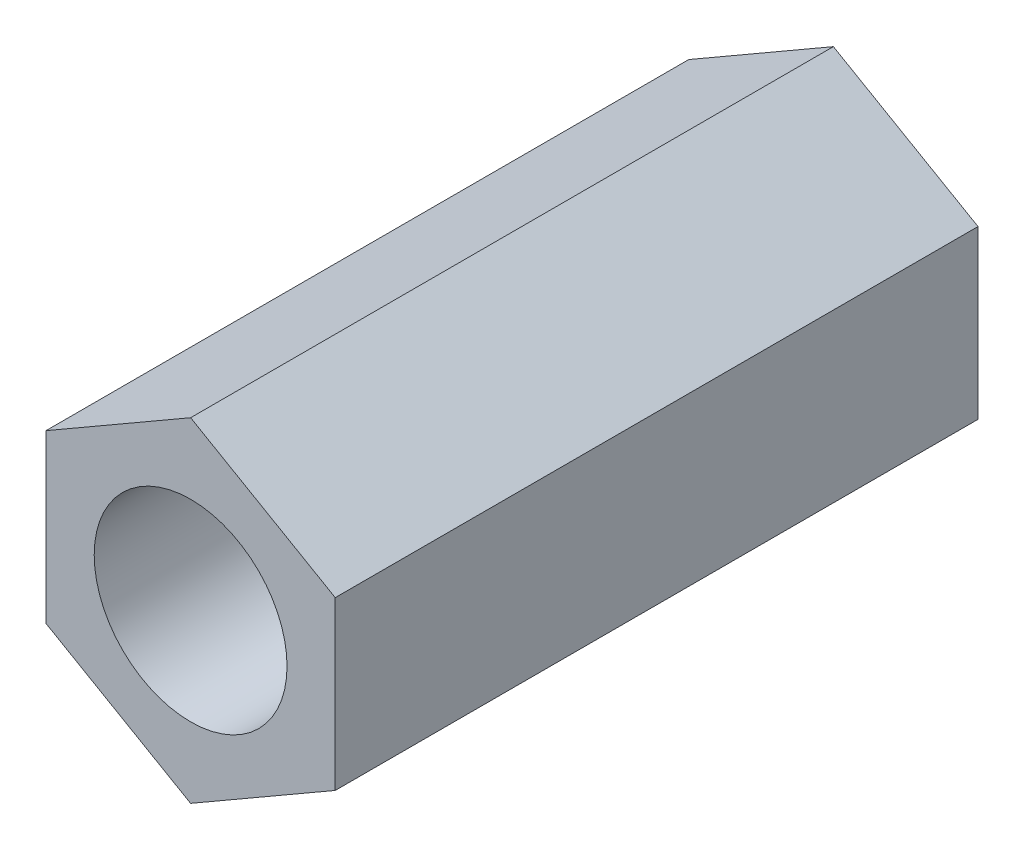
ISO-10303-21;
HEADER;
FILE_DESCRIPTION(('STEP AP214'),'2;1');
FILE_NAME('part.step','',(''),(''),'','','');
FILE_SCHEMA(('AUTOMOTIVE_DESIGN { 1 0 10303 214 1 1 1 1 }'));
ENDSEC;
DATA;
#1=APPLICATION_CONTEXT('core data for automotive mechanical design processes');
#2=APPLICATION_PROTOCOL_DEFINITION('international standard','automotive_design',2000,#1);
#3=PRODUCT_CONTEXT('',#1,'mechanical');
#4=PRODUCT('Part','Part','',(#3));
#5=PRODUCT_RELATED_PRODUCT_CATEGORY('part','',(#4));
#6=PRODUCT_DEFINITION_FORMATION('','',#4);
#7=PRODUCT_DEFINITION_CONTEXT('part definition',#1,'design');
#8=PRODUCT_DEFINITION('design','',#6,#7);
#9=PRODUCT_DEFINITION_SHAPE('','',#8);
#10=(LENGTH_UNIT() NAMED_UNIT(*) SI_UNIT(.MILLI.,.METRE.));
#11=(NAMED_UNIT(*) PLANE_ANGLE_UNIT() SI_UNIT($,.RADIAN.));
#12=(NAMED_UNIT(*) SI_UNIT($,.STERADIAN.) SOLID_ANGLE_UNIT());
#13=UNCERTAINTY_MEASURE_WITH_UNIT(LENGTH_MEASURE(1.E-05),#10,'distance_accuracy_value','');
#14=(GEOMETRIC_REPRESENTATION_CONTEXT(3) GLOBAL_UNCERTAINTY_ASSIGNED_CONTEXT((#13)) GLOBAL_UNIT_ASSIGNED_CONTEXT((#10,
#11,#12)) REPRESENTATION_CONTEXT('',''));
#15=CARTESIAN_POINT('',(0.,0.,0.));
#16=DIRECTION('',(0.,0.,1.));
#17=DIRECTION('',(1.,0.,0.));
#18=AXIS2_PLACEMENT_3D('',#15,#16,#17);
#19=CARTESIAN_POINT('',(0.,2.59807621135332,5.));
#20=DIRECTION('',(0.,0.,1.));
#21=DIRECTION('',(1.,0.,0.));
#22=AXIS2_PLACEMENT_3D('',#19,#20,#21);
#23=PLANE('',#22);
#24=DIRECTION('',(-0.866025403784439,0.499999999999999,0.));
#25=VECTOR('',#24,1.);
#26=CARTESIAN_POINT('',(2.25,1.29903810567666,5.));
#27=LINE('',#26,#25);
#28=CARTESIAN_POINT('',(2.25,1.29903810567666,5.));
#29=VERTEX_POINT('',#28);
#30=CARTESIAN_POINT('',(0.,2.59807621135332,5.));
#31=VERTEX_POINT('',#30);
#32=EDGE_CURVE('E123',#29,#31,#27,.T.);
#33=ORIENTED_EDGE('',*,*,#32,.T.);
#34=DIRECTION('',(-0.866025403784438,-0.5,0.));
#35=VECTOR('',#34,1.);
#36=CARTESIAN_POINT('',(0.,2.59807621135332,5.));
#37=LINE('',#36,#35);
#38=CARTESIAN_POINT('',(-2.25,1.29903810567666,5.));
#39=VERTEX_POINT('',#38);
#40=EDGE_CURVE('E90',#31,#39,#37,.T.);
#41=ORIENTED_EDGE('',*,*,#40,.T.);
#42=DIRECTION('',(0.,-1.,0.));
#43=VECTOR('',#42,1.);
#44=CARTESIAN_POINT('',(-2.25,1.29903810567666,5.));
#45=LINE('',#44,#43);
#46=CARTESIAN_POINT('',(-2.25,-1.29903810567666,5.));
#47=VERTEX_POINT('',#46);
#48=EDGE_CURVE('E126',#39,#47,#45,.T.);
#49=ORIENTED_EDGE('',*,*,#48,.T.);
#50=DIRECTION('',(0.866025403784439,-0.499999999999999,0.));
#51=VECTOR('',#50,1.);
#52=CARTESIAN_POINT('',(-2.25,-1.29903810567666,5.));
#53=LINE('',#52,#51);
#54=CARTESIAN_POINT('',(0.,-2.59807621135331,5.));
#55=VERTEX_POINT('',#54);
#56=EDGE_CURVE('E128',#47,#55,#53,.T.);
#57=ORIENTED_EDGE('',*,*,#56,.T.);
#58=DIRECTION('',(0.866025403784438,0.5,0.));
#59=VECTOR('',#58,1.);
#60=CARTESIAN_POINT('',(0.,-2.59807621135331,5.));
#61=LINE('',#60,#59);
#62=CARTESIAN_POINT('',(2.25,-1.29903810567666,5.));
#63=VERTEX_POINT('',#62);
#64=EDGE_CURVE('E54',#55,#63,#61,.T.);
#65=ORIENTED_EDGE('',*,*,#64,.T.);
#66=DIRECTION('',(0.,1.,0.));
#67=VECTOR('',#66,1.);
#68=CARTESIAN_POINT('',(2.25,-1.29903810567666,5.));
#69=LINE('',#68,#67);
#70=EDGE_CURVE('E49',#63,#29,#69,.T.);
#71=ORIENTED_EDGE('',*,*,#70,.T.);
#72=EDGE_LOOP('',(#33,#41,#49,#57,#65,#71));
#73=FACE_BOUND('',#72,.T.);
#74=CARTESIAN_POINT('',(0.,0.,5.));
#75=DIRECTION('',(0.,0.,1.));
#76=DIRECTION('',(1.,0.,0.));
#77=AXIS2_PLACEMENT_3D('',#74,#75,#76);
#78=CIRCLE('',#77,1.5);
#79=CARTESIAN_POINT('',(1.5,0.,5.));
#80=VERTEX_POINT('',#79);
#81=EDGE_CURVE('E120',#80,#80,#78,.T.);
#82=ORIENTED_EDGE('',*,*,#81,.F.);
#83=EDGE_LOOP('',(#82));
#84=FACE_BOUND('',#83,.T.);
#85=ADVANCED_FACE('F34',(#73,#84),#23,.T.);
#86=CARTESIAN_POINT('',(2.25,1.29903810567666,5.));
#87=DIRECTION('',(-0.499999999999999,-0.866025403784439,0.));
#88=DIRECTION('',(0.866025403784439,-0.499999999999999,0.));
#89=AXIS2_PLACEMENT_3D('',#86,#87,#88);
#90=PLANE('',#89);
#91=DIRECTION('',(0.,0.,-1.));
#92=VECTOR('',#91,1.);
#93=CARTESIAN_POINT('',(2.25,1.29903810567666,5.));
#94=LINE('',#93,#92);
#95=CARTESIAN_POINT('',(2.25,1.29903810567666,-5.));
#96=VERTEX_POINT('',#95);
#97=EDGE_CURVE('E105',#29,#96,#94,.T.);
#98=ORIENTED_EDGE('',*,*,#97,.T.);
#99=DIRECTION('',(-0.866025403784439,0.499999999999999,0.));
#100=VECTOR('',#99,1.);
#101=CARTESIAN_POINT('',(2.25,1.29903810567666,-5.));
#102=LINE('',#101,#100);
#103=CARTESIAN_POINT('',(0.,2.59807621135332,-5.));
#104=VERTEX_POINT('',#103);
#105=EDGE_CURVE('E99',#96,#104,#102,.T.);
#106=ORIENTED_EDGE('',*,*,#105,.T.);
#107=DIRECTION('',(0.,0.,-1.));
#108=VECTOR('',#107,1.);
#109=CARTESIAN_POINT('',(0.,2.59807621135332,5.));
#110=LINE('',#109,#108);
#111=EDGE_CURVE('E11',#31,#104,#110,.T.);
#112=ORIENTED_EDGE('',*,*,#111,.F.);
#113=ORIENTED_EDGE('',*,*,#32,.F.);
#114=EDGE_LOOP('',(#98,#106,#112,#113));
#115=FACE_BOUND('',#114,.T.);
#116=ADVANCED_FACE('F36',(#115),#90,.F.);
#117=CARTESIAN_POINT('',(0.,2.59807621135332,5.));
#118=DIRECTION('',(0.5,-0.866025403784439,0.));
#119=DIRECTION('',(0.866025403784439,0.5,0.));
#120=AXIS2_PLACEMENT_3D('',#117,#118,#119);
#121=PLANE('',#120);
#122=ORIENTED_EDGE('',*,*,#111,.T.);
#123=DIRECTION('',(-0.866025403784438,-0.5,0.));
#124=VECTOR('',#123,1.);
#125=CARTESIAN_POINT('',(0.,2.59807621135332,-5.));
#126=LINE('',#125,#124);
#127=CARTESIAN_POINT('',(-2.25,1.29903810567666,-5.));
#128=VERTEX_POINT('',#127);
#129=EDGE_CURVE('E89',#104,#128,#126,.T.);
#130=ORIENTED_EDGE('',*,*,#129,.T.);
#131=DIRECTION('',(0.,0.,-1.));
#132=VECTOR('',#131,1.);
#133=CARTESIAN_POINT('',(-2.25,1.29903810567666,5.));
#134=LINE('',#133,#132);
#135=EDGE_CURVE('E42',#39,#128,#134,.T.);
#136=ORIENTED_EDGE('',*,*,#135,.F.);
#137=ORIENTED_EDGE('',*,*,#40,.F.);
#138=EDGE_LOOP('',(#122,#130,#136,#137));
#139=FACE_BOUND('',#138,.T.);
#140=ADVANCED_FACE('F87',(#139),#121,.F.);
#141=CARTESIAN_POINT('',(-2.25,1.29903810567666,5.));
#142=DIRECTION('',(1.,0.,0.));
#143=DIRECTION('',(0.,0.,-1.));
#144=AXIS2_PLACEMENT_3D('',#141,#142,#143);
#145=PLANE('',#144);
#146=ORIENTED_EDGE('',*,*,#135,.T.);
#147=DIRECTION('',(0.,-1.,0.));
#148=VECTOR('',#147,1.);
#149=CARTESIAN_POINT('',(-2.25,1.29903810567666,-5.));
#150=LINE('',#149,#148);
#151=CARTESIAN_POINT('',(-2.25,-1.29903810567666,-5.));
#152=VERTEX_POINT('',#151);
#153=EDGE_CURVE('E103',#128,#152,#150,.T.);
#154=ORIENTED_EDGE('',*,*,#153,.T.);
#155=DIRECTION('',(0.,0.,-1.));
#156=VECTOR('',#155,1.);
#157=CARTESIAN_POINT('',(-2.25,-1.29903810567666,5.));
#158=LINE('',#157,#156);
#159=EDGE_CURVE('E137',#47,#152,#158,.T.);
#160=ORIENTED_EDGE('',*,*,#159,.F.);
#161=ORIENTED_EDGE('',*,*,#48,.F.);
#162=EDGE_LOOP('',(#146,#154,#160,#161));
#163=FACE_BOUND('',#162,.T.);
#164=ADVANCED_FACE('F140',(#163),#145,.F.);
#165=CARTESIAN_POINT('',(-2.25,-1.29903810567666,5.));
#166=DIRECTION('',(0.5,0.866025403784439,0.));
#167=DIRECTION('',(-0.866025403784439,0.5,0.));
#168=AXIS2_PLACEMENT_3D('',#165,#166,#167);
#169=PLANE('',#168);
#170=ORIENTED_EDGE('',*,*,#159,.T.);
#171=DIRECTION('',(0.866025403784439,-0.499999999999999,0.));
#172=VECTOR('',#171,1.);
#173=CARTESIAN_POINT('',(-2.25,-1.29903810567666,-5.));
#174=LINE('',#173,#172);
#175=CARTESIAN_POINT('',(0.,-2.59807621135331,-5.));
#176=VERTEX_POINT('',#175);
#177=EDGE_CURVE('E112',#152,#176,#174,.T.);
#178=ORIENTED_EDGE('',*,*,#177,.T.);
#179=DIRECTION('',(0.,0.,-1.));
#180=VECTOR('',#179,1.);
#181=CARTESIAN_POINT('',(0.,-2.59807621135331,5.));
#182=LINE('',#181,#180);
#183=EDGE_CURVE('E135',#55,#176,#182,.T.);
#184=ORIENTED_EDGE('',*,*,#183,.F.);
#185=ORIENTED_EDGE('',*,*,#56,.F.);
#186=EDGE_LOOP('',(#170,#178,#184,#185));
#187=FACE_BOUND('',#186,.T.);
#188=ADVANCED_FACE('F146',(#187),#169,.F.);
#189=CARTESIAN_POINT('',(0.,-2.59807621135331,5.));
#190=DIRECTION('',(-0.5,0.866025403784438,0.));
#191=DIRECTION('',(-0.866025403784439,-0.5,0.));
#192=AXIS2_PLACEMENT_3D('',#189,#190,#191);
#193=PLANE('',#192);
#194=ORIENTED_EDGE('',*,*,#183,.T.);
#195=DIRECTION('',(0.866025403784438,0.5,0.));
#196=VECTOR('',#195,1.);
#197=CARTESIAN_POINT('',(0.,-2.59807621135331,-5.));
#198=LINE('',#197,#196);
#199=CARTESIAN_POINT('',(2.25,-1.29903810567666,-5.));
#200=VERTEX_POINT('',#199);
#201=EDGE_CURVE('E115',#176,#200,#198,.T.);
#202=ORIENTED_EDGE('',*,*,#201,.T.);
#203=DIRECTION('',(0.,0.,-1.));
#204=VECTOR('',#203,1.);
#205=CARTESIAN_POINT('',(2.25,-1.29903810567666,5.));
#206=LINE('',#205,#204);
#207=EDGE_CURVE('E133',#63,#200,#206,.T.);
#208=ORIENTED_EDGE('',*,*,#207,.F.);
#209=ORIENTED_EDGE('',*,*,#64,.F.);
#210=EDGE_LOOP('',(#194,#202,#208,#209));
#211=FACE_BOUND('',#210,.T.);
#212=ADVANCED_FACE('F149',(#211),#193,.F.);
#213=CARTESIAN_POINT('',(2.25,-1.29903810567666,5.));
#214=DIRECTION('',(-1.,0.,0.));
#215=DIRECTION('',(0.,-1.,0.));
#216=AXIS2_PLACEMENT_3D('',#213,#214,#215);
#217=PLANE('',#216);
#218=ORIENTED_EDGE('',*,*,#207,.T.);
#219=DIRECTION('',(0.,1.,0.));
#220=VECTOR('',#219,1.);
#221=CARTESIAN_POINT('',(2.25,-1.29903810567666,-5.));
#222=LINE('',#221,#220);
#223=EDGE_CURVE('E118',#200,#96,#222,.T.);
#224=ORIENTED_EDGE('',*,*,#223,.T.);
#225=ORIENTED_EDGE('',*,*,#97,.F.);
#226=ORIENTED_EDGE('',*,*,#70,.F.);
#227=EDGE_LOOP('',(#218,#224,#225,#226));
#228=FACE_BOUND('',#227,.T.);
#229=ADVANCED_FACE('F151',(#228),#217,.F.);
#230=CARTESIAN_POINT('',(0.,0.,5.));
#231=DIRECTION('',(0.,0.,-1.));
#232=DIRECTION('',(-1.,0.,0.));
#233=AXIS2_PLACEMENT_3D('',#230,#231,#232);
#234=CYLINDRICAL_SURFACE('',#233,1.5);
#235=ORIENTED_EDGE('',*,*,#81,.T.);
#236=EDGE_LOOP('',(#235));
#237=FACE_BOUND('',#236,.T.);
#238=CARTESIAN_POINT('',(0.,0.,-5.));
#239=DIRECTION('',(0.,0.,1.));
#240=DIRECTION('',(1.,0.,0.));
#241=AXIS2_PLACEMENT_3D('',#238,#239,#240);
#242=CIRCLE('',#241,1.5);
#243=CARTESIAN_POINT('',(1.5,0.,-5.));
#244=VERTEX_POINT('',#243);
#245=EDGE_CURVE('E106',#244,#244,#242,.T.);
#246=ORIENTED_EDGE('',*,*,#245,.F.);
#247=EDGE_LOOP('',(#246));
#248=FACE_BOUND('',#247,.T.);
#249=ADVANCED_FACE('F153',(#237,#248),#234,.F.);
#250=CARTESIAN_POINT('',(0.,2.59807621135332,-5.));
#251=DIRECTION('',(0.,0.,1.));
#252=DIRECTION('',(1.,0.,0.));
#253=AXIS2_PLACEMENT_3D('',#250,#251,#252);
#254=PLANE('',#253);
#255=ORIENTED_EDGE('',*,*,#245,.T.);
#256=EDGE_LOOP('',(#255));
#257=FACE_BOUND('',#256,.T.);
#258=ORIENTED_EDGE('',*,*,#105,.F.);
#259=ORIENTED_EDGE('',*,*,#223,.F.);
#260=ORIENTED_EDGE('',*,*,#201,.F.);
#261=ORIENTED_EDGE('',*,*,#177,.F.);
#262=ORIENTED_EDGE('',*,*,#153,.F.);
#263=ORIENTED_EDGE('',*,*,#129,.F.);
#264=EDGE_LOOP('',(#258,#259,#260,#261,#262,#263));
#265=FACE_BOUND('',#264,.T.);
#266=ADVANCED_FACE('F97',(#257,#265),#254,.F.);
#267=CLOSED_SHELL('',(#85,#116,#140,#164,#188,#212,#229,#249,#266));
#268=MANIFOLD_SOLID_BREP('B2',#267);
#269=ADVANCED_BREP_SHAPE_REPRESENTATION('',(#18,#268),#14);
#270=SHAPE_DEFINITION_REPRESENTATION(#9,#269);
ENDSEC;
END-ISO-10303-21;
